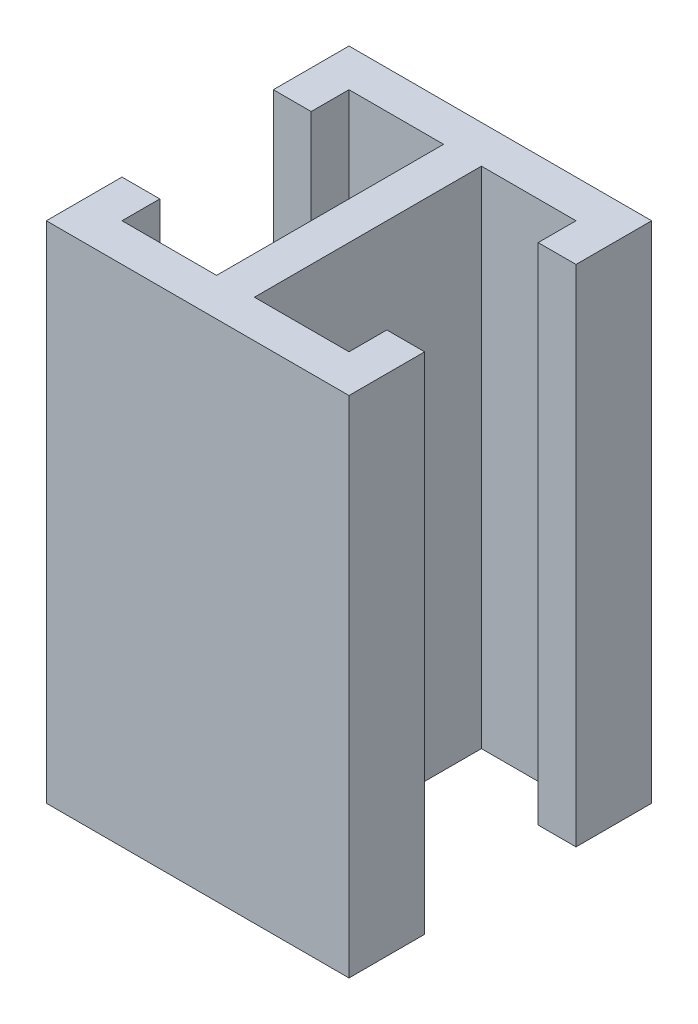
ISO-10303-21;
HEADER;
FILE_DESCRIPTION(('STEP AP214'),'2;1');
FILE_NAME('part.step','',(''),(''),'','','');
FILE_SCHEMA(('AUTOMOTIVE_DESIGN { 1 0 10303 214 1 1 1 1 }'));
ENDSEC;
DATA;
#1=APPLICATION_CONTEXT('core data for automotive mechanical design processes');
#2=APPLICATION_PROTOCOL_DEFINITION('international standard','automotive_design',2000,#1);
#3=PRODUCT_CONTEXT('',#1,'mechanical');
#4=PRODUCT('Part','Part','',(#3));
#5=PRODUCT_RELATED_PRODUCT_CATEGORY('part','',(#4));
#6=PRODUCT_DEFINITION_FORMATION('','',#4);
#7=PRODUCT_DEFINITION_CONTEXT('part definition',#1,'design');
#8=PRODUCT_DEFINITION('design','',#6,#7);
#9=PRODUCT_DEFINITION_SHAPE('','',#8);
#10=(LENGTH_UNIT() NAMED_UNIT(*) SI_UNIT(.MILLI.,.METRE.));
#11=(NAMED_UNIT(*) PLANE_ANGLE_UNIT() SI_UNIT($,.RADIAN.));
#12=(NAMED_UNIT(*) SI_UNIT($,.STERADIAN.) SOLID_ANGLE_UNIT());
#13=UNCERTAINTY_MEASURE_WITH_UNIT(LENGTH_MEASURE(1.E-05),#10,'distance_accuracy_value','');
#14=(GEOMETRIC_REPRESENTATION_CONTEXT(3) GLOBAL_UNCERTAINTY_ASSIGNED_CONTEXT((#13)) GLOBAL_UNIT_ASSIGNED_CONTEXT((#10,
#11,#12)) REPRESENTATION_CONTEXT('',''));
#15=CARTESIAN_POINT('',(0.,0.,0.));
#16=DIRECTION('',(0.,0.,1.));
#17=DIRECTION('',(1.,0.,0.));
#18=AXIS2_PLACEMENT_3D('',#15,#16,#17);
#19=CARTESIAN_POINT('',(0.,200.,0.));
#20=DIRECTION('',(1.,0.,0.));
#21=DIRECTION('',(0.,0.,-1.));
#22=AXIS2_PLACEMENT_3D('',#19,#20,#21);
#23=PLANE('',#22);
#24=DIRECTION('',(0.,0.,1.));
#25=VECTOR('',#24,1.);
#26=CARTESIAN_POINT('',(0.,0.,0.));
#27=LINE('',#26,#25);
#28=CARTESIAN_POINT('',(0.,0.,-30.));
#29=VERTEX_POINT('',#28);
#30=CARTESIAN_POINT('',(0.,0.,0.));
#31=VERTEX_POINT('',#30);
#32=EDGE_CURVE('E208',#29,#31,#27,.T.);
#33=ORIENTED_EDGE('',*,*,#32,.T.);
#34=DIRECTION('',(0.,-1.,0.));
#35=VECTOR('',#34,1.);
#36=CARTESIAN_POINT('',(0.,200.,0.));
#37=LINE('',#36,#35);
#38=CARTESIAN_POINT('',(0.,200.,0.));
#39=VERTEX_POINT('',#38);
#40=EDGE_CURVE('E11',#39,#31,#37,.T.);
#41=ORIENTED_EDGE('',*,*,#40,.F.);
#42=DIRECTION('',(0.,0.,1.));
#43=VECTOR('',#42,1.);
#44=CARTESIAN_POINT('',(0.,200.,0.));
#45=LINE('',#44,#43);
#46=CARTESIAN_POINT('',(0.,200.,-30.));
#47=VERTEX_POINT('',#46);
#48=EDGE_CURVE('E246',#47,#39,#45,.T.);
#49=ORIENTED_EDGE('',*,*,#48,.F.);
#50=DIRECTION('',(0.,-1.,0.));
#51=VECTOR('',#50,1.);
#52=CARTESIAN_POINT('',(0.,200.,-30.));
#53=LINE('',#52,#51);
#54=EDGE_CURVE('E204',#47,#29,#53,.T.);
#55=ORIENTED_EDGE('',*,*,#54,.T.);
#56=EDGE_LOOP('',(#33,#41,#49,#55));
#57=FACE_BOUND('',#56,.T.);
#58=ADVANCED_FACE('F40',(#57),#23,.F.);
#59=CARTESIAN_POINT('',(0.,200.,0.));
#60=DIRECTION('',(0.,0.,-1.));
#61=DIRECTION('',(-1.,0.,0.));
#62=AXIS2_PLACEMENT_3D('',#59,#60,#61);
#63=PLANE('',#62);
#64=DIRECTION('',(1.,0.,0.));
#65=VECTOR('',#64,1.);
#66=CARTESIAN_POINT('',(0.,0.,0.));
#67=LINE('',#66,#65);
#68=CARTESIAN_POINT('',(120.,0.,0.));
#69=VERTEX_POINT('',#68);
#70=EDGE_CURVE('E211',#31,#69,#67,.T.);
#71=ORIENTED_EDGE('',*,*,#70,.T.);
#72=DIRECTION('',(0.,-1.,0.));
#73=VECTOR('',#72,1.);
#74=CARTESIAN_POINT('',(120.,200.,0.));
#75=LINE('',#74,#73);
#76=CARTESIAN_POINT('',(120.,200.,0.));
#77=VERTEX_POINT('',#76);
#78=EDGE_CURVE('E48',#77,#69,#75,.T.);
#79=ORIENTED_EDGE('',*,*,#78,.F.);
#80=DIRECTION('',(1.,0.,0.));
#81=VECTOR('',#80,1.);
#82=CARTESIAN_POINT('',(0.,200.,0.));
#83=LINE('',#82,#81);
#84=EDGE_CURVE('E135',#39,#77,#83,.T.);
#85=ORIENTED_EDGE('',*,*,#84,.F.);
#86=ORIENTED_EDGE('',*,*,#40,.T.);
#87=EDGE_LOOP('',(#71,#79,#85,#86));
#88=FACE_BOUND('',#87,.T.);
#89=ADVANCED_FACE('F364',(#88),#63,.F.);
#90=CARTESIAN_POINT('',(120.,200.,0.));
#91=DIRECTION('',(-1.,0.,0.));
#92=DIRECTION('',(0.,0.,1.));
#93=AXIS2_PLACEMENT_3D('',#90,#91,#92);
#94=PLANE('',#93);
#95=DIRECTION('',(0.,0.,-1.));
#96=VECTOR('',#95,1.);
#97=CARTESIAN_POINT('',(120.,0.,0.));
#98=LINE('',#97,#96);
#99=CARTESIAN_POINT('',(120.,0.,-30.));
#100=VERTEX_POINT('',#99);
#101=EDGE_CURVE('E213',#69,#100,#98,.T.);
#102=ORIENTED_EDGE('',*,*,#101,.T.);
#103=DIRECTION('',(0.,-1.,0.));
#104=VECTOR('',#103,1.);
#105=CARTESIAN_POINT('',(120.,200.,-30.));
#106=LINE('',#105,#104);
#107=CARTESIAN_POINT('',(120.,200.,-30.));
#108=VERTEX_POINT('',#107);
#109=EDGE_CURVE('E289',#108,#100,#106,.T.);
#110=ORIENTED_EDGE('',*,*,#109,.F.);
#111=DIRECTION('',(0.,0.,-1.));
#112=VECTOR('',#111,1.);
#113=CARTESIAN_POINT('',(120.,200.,0.));
#114=LINE('',#113,#112);
#115=EDGE_CURVE('E297',#77,#108,#114,.T.);
#116=ORIENTED_EDGE('',*,*,#115,.F.);
#117=ORIENTED_EDGE('',*,*,#78,.T.);
#118=EDGE_LOOP('',(#102,#110,#116,#117));
#119=FACE_BOUND('',#118,.T.);
#120=ADVANCED_FACE('F295',(#119),#94,.F.);
#121=CARTESIAN_POINT('',(105.,200.,-30.));
#122=DIRECTION('',(0.,0.,1.));
#123=DIRECTION('',(1.,0.,0.));
#124=AXIS2_PLACEMENT_3D('',#121,#122,#123);
#125=PLANE('',#124);
#126=DIRECTION('',(-1.,0.,0.));
#127=VECTOR('',#126,1.);
#128=CARTESIAN_POINT('',(105.,0.,-30.));
#129=LINE('',#128,#127);
#130=CARTESIAN_POINT('',(105.,0.,-30.));
#131=VERTEX_POINT('',#130);
#132=EDGE_CURVE('E215',#100,#131,#129,.T.);
#133=ORIENTED_EDGE('',*,*,#132,.T.);
#134=DIRECTION('',(0.,-1.,0.));
#135=VECTOR('',#134,1.);
#136=CARTESIAN_POINT('',(105.,200.,-30.));
#137=LINE('',#136,#135);
#138=CARTESIAN_POINT('',(105.,200.,-30.));
#139=VERTEX_POINT('',#138);
#140=EDGE_CURVE('E286',#139,#131,#137,.T.);
#141=ORIENTED_EDGE('',*,*,#140,.F.);
#142=DIRECTION('',(-1.,0.,0.));
#143=VECTOR('',#142,1.);
#144=CARTESIAN_POINT('',(105.,200.,-30.));
#145=LINE('',#144,#143);
#146=EDGE_CURVE('E315',#108,#139,#145,.T.);
#147=ORIENTED_EDGE('',*,*,#146,.F.);
#148=ORIENTED_EDGE('',*,*,#109,.T.);
#149=EDGE_LOOP('',(#133,#141,#147,#148));
#150=FACE_BOUND('',#149,.T.);
#151=ADVANCED_FACE('F306',(#150),#125,.F.);
#152=CARTESIAN_POINT('',(105.,200.,-30.));
#153=DIRECTION('',(1.,0.,0.));
#154=DIRECTION('',(0.,0.,-1.));
#155=AXIS2_PLACEMENT_3D('',#152,#153,#154);
#156=PLANE('',#155);
#157=DIRECTION('',(0.,0.,1.));
#158=VECTOR('',#157,1.);
#159=CARTESIAN_POINT('',(105.,0.,-30.));
#160=LINE('',#159,#158);
#161=CARTESIAN_POINT('',(105.,0.,-15.));
#162=VERTEX_POINT('',#161);
#163=EDGE_CURVE('E217',#131,#162,#160,.T.);
#164=ORIENTED_EDGE('',*,*,#163,.T.);
#165=DIRECTION('',(0.,-1.,0.));
#166=VECTOR('',#165,1.);
#167=CARTESIAN_POINT('',(105.,200.,-15.));
#168=LINE('',#167,#166);
#169=CARTESIAN_POINT('',(105.,200.,-15.));
#170=VERTEX_POINT('',#169);
#171=EDGE_CURVE('E283',#170,#162,#168,.T.);
#172=ORIENTED_EDGE('',*,*,#171,.F.);
#173=DIRECTION('',(0.,0.,1.));
#174=VECTOR('',#173,1.);
#175=CARTESIAN_POINT('',(105.,200.,-30.));
#176=LINE('',#175,#174);
#177=EDGE_CURVE('E312',#139,#170,#176,.T.);
#178=ORIENTED_EDGE('',*,*,#177,.F.);
#179=ORIENTED_EDGE('',*,*,#140,.T.);
#180=EDGE_LOOP('',(#164,#172,#178,#179));
#181=FACE_BOUND('',#180,.T.);
#182=ADVANCED_FACE('F310',(#181),#156,.F.);
#183=CARTESIAN_POINT('',(67.5,200.,-15.));
#184=DIRECTION('',(0.,0.,1.));
#185=DIRECTION('',(1.,0.,0.));
#186=AXIS2_PLACEMENT_3D('',#183,#184,#185);
#187=PLANE('',#186);
#188=DIRECTION('',(-1.,0.,0.));
#189=VECTOR('',#188,1.);
#190=CARTESIAN_POINT('',(67.5,0.,-15.));
#191=LINE('',#190,#189);
#192=CARTESIAN_POINT('',(67.5,0.,-15.));
#193=VERTEX_POINT('',#192);
#194=EDGE_CURVE('E219',#162,#193,#191,.T.);
#195=ORIENTED_EDGE('',*,*,#194,.T.);
#196=DIRECTION('',(0.,-1.,0.));
#197=VECTOR('',#196,1.);
#198=CARTESIAN_POINT('',(67.5,200.,-15.));
#199=LINE('',#198,#197);
#200=CARTESIAN_POINT('',(67.5,200.,-15.));
#201=VERTEX_POINT('',#200);
#202=EDGE_CURVE('E280',#201,#193,#199,.T.);
#203=ORIENTED_EDGE('',*,*,#202,.F.);
#204=DIRECTION('',(-1.,0.,0.));
#205=VECTOR('',#204,1.);
#206=CARTESIAN_POINT('',(67.5,200.,-15.));
#207=LINE('',#206,#205);
#208=EDGE_CURVE('E314',#170,#201,#207,.T.);
#209=ORIENTED_EDGE('',*,*,#208,.F.);
#210=ORIENTED_EDGE('',*,*,#171,.T.);
#211=EDGE_LOOP('',(#195,#203,#209,#210));
#212=FACE_BOUND('',#211,.T.);
#213=ADVANCED_FACE('F377',(#212),#187,.F.);
#214=CARTESIAN_POINT('',(67.5,200.,-105.));
#215=DIRECTION('',(-1.,0.,0.));
#216=DIRECTION('',(0.,0.,1.));
#217=AXIS2_PLACEMENT_3D('',#214,#215,#216);
#218=PLANE('',#217);
#219=DIRECTION('',(0.,0.,-1.));
#220=VECTOR('',#219,1.);
#221=CARTESIAN_POINT('',(67.5,0.,-105.));
#222=LINE('',#221,#220);
#223=CARTESIAN_POINT('',(67.5,0.,-105.));
#224=VERTEX_POINT('',#223);
#225=EDGE_CURVE('E221',#193,#224,#222,.T.);
#226=ORIENTED_EDGE('',*,*,#225,.T.);
#227=DIRECTION('',(0.,-1.,0.));
#228=VECTOR('',#227,1.);
#229=CARTESIAN_POINT('',(67.5,200.,-105.));
#230=LINE('',#229,#228);
#231=CARTESIAN_POINT('',(67.5,200.,-105.));
#232=VERTEX_POINT('',#231);
#233=EDGE_CURVE('E277',#232,#224,#230,.T.);
#234=ORIENTED_EDGE('',*,*,#233,.F.);
#235=DIRECTION('',(0.,0.,-1.));
#236=VECTOR('',#235,1.);
#237=CARTESIAN_POINT('',(67.5,200.,-105.));
#238=LINE('',#237,#236);
#239=EDGE_CURVE('E317',#201,#232,#238,.T.);
#240=ORIENTED_EDGE('',*,*,#239,.F.);
#241=ORIENTED_EDGE('',*,*,#202,.T.);
#242=EDGE_LOOP('',(#226,#234,#240,#241));
#243=FACE_BOUND('',#242,.T.);
#244=ADVANCED_FACE('F380',(#243),#218,.F.);
#245=CARTESIAN_POINT('',(67.5,200.,-105.));
#246=DIRECTION('',(0.,0.,-1.));
#247=DIRECTION('',(-1.,0.,0.));
#248=AXIS2_PLACEMENT_3D('',#245,#246,#247);
#249=PLANE('',#248);
#250=DIRECTION('',(1.,0.,0.));
#251=VECTOR('',#250,1.);
#252=CARTESIAN_POINT('',(67.5,0.,-105.));
#253=LINE('',#252,#251);
#254=CARTESIAN_POINT('',(105.,0.,-105.));
#255=VERTEX_POINT('',#254);
#256=EDGE_CURVE('E223',#224,#255,#253,.T.);
#257=ORIENTED_EDGE('',*,*,#256,.T.);
#258=DIRECTION('',(0.,-1.,0.));
#259=VECTOR('',#258,1.);
#260=CARTESIAN_POINT('',(105.,200.,-105.));
#261=LINE('',#260,#259);
#262=CARTESIAN_POINT('',(105.,200.,-105.));
#263=VERTEX_POINT('',#262);
#264=EDGE_CURVE('E274',#263,#255,#261,.T.);
#265=ORIENTED_EDGE('',*,*,#264,.F.);
#266=DIRECTION('',(1.,0.,0.));
#267=VECTOR('',#266,1.);
#268=CARTESIAN_POINT('',(67.5,200.,-105.));
#269=LINE('',#268,#267);
#270=EDGE_CURVE('E323',#232,#263,#269,.T.);
#271=ORIENTED_EDGE('',*,*,#270,.F.);
#272=ORIENTED_EDGE('',*,*,#233,.T.);
#273=EDGE_LOOP('',(#257,#265,#271,#272));
#274=FACE_BOUND('',#273,.T.);
#275=ADVANCED_FACE('F384',(#274),#249,.F.);
#276=CARTESIAN_POINT('',(105.,200.,-105.));
#277=DIRECTION('',(1.,0.,0.));
#278=DIRECTION('',(0.,0.,-1.));
#279=AXIS2_PLACEMENT_3D('',#276,#277,#278);
#280=PLANE('',#279);
#281=DIRECTION('',(0.,0.,1.));
#282=VECTOR('',#281,1.);
#283=CARTESIAN_POINT('',(105.,0.,-105.));
#284=LINE('',#283,#282);
#285=CARTESIAN_POINT('',(105.,0.,-90.));
#286=VERTEX_POINT('',#285);
#287=EDGE_CURVE('E225',#255,#286,#284,.T.);
#288=ORIENTED_EDGE('',*,*,#287,.T.);
#289=DIRECTION('',(0.,-1.,0.));
#290=VECTOR('',#289,1.);
#291=CARTESIAN_POINT('',(105.,200.,-90.));
#292=LINE('',#291,#290);
#293=CARTESIAN_POINT('',(105.,200.,-90.));
#294=VERTEX_POINT('',#293);
#295=EDGE_CURVE('E271',#294,#286,#292,.T.);
#296=ORIENTED_EDGE('',*,*,#295,.F.);
#297=DIRECTION('',(0.,0.,1.));
#298=VECTOR('',#297,1.);
#299=CARTESIAN_POINT('',(105.,200.,-105.));
#300=LINE('',#299,#298);
#301=EDGE_CURVE('E325',#263,#294,#300,.T.);
#302=ORIENTED_EDGE('',*,*,#301,.F.);
#303=ORIENTED_EDGE('',*,*,#264,.T.);
#304=EDGE_LOOP('',(#288,#296,#302,#303));
#305=FACE_BOUND('',#304,.T.);
#306=ADVANCED_FACE('F388',(#305),#280,.F.);
#307=CARTESIAN_POINT('',(105.,200.,-90.));
#308=DIRECTION('',(0.,0.,-1.));
#309=DIRECTION('',(-1.,0.,0.));
#310=AXIS2_PLACEMENT_3D('',#307,#308,#309);
#311=PLANE('',#310);
#312=DIRECTION('',(1.,0.,0.));
#313=VECTOR('',#312,1.);
#314=CARTESIAN_POINT('',(105.,0.,-90.));
#315=LINE('',#314,#313);
#316=CARTESIAN_POINT('',(120.,0.,-90.));
#317=VERTEX_POINT('',#316);
#318=EDGE_CURVE('E227',#286,#317,#315,.T.);
#319=ORIENTED_EDGE('',*,*,#318,.T.);
#320=DIRECTION('',(0.,-1.,0.));
#321=VECTOR('',#320,1.);
#322=CARTESIAN_POINT('',(120.,200.,-90.));
#323=LINE('',#322,#321);
#324=CARTESIAN_POINT('',(120.,200.,-90.));
#325=VERTEX_POINT('',#324);
#326=EDGE_CURVE('E268',#325,#317,#323,.T.);
#327=ORIENTED_EDGE('',*,*,#326,.F.);
#328=DIRECTION('',(1.,0.,0.));
#329=VECTOR('',#328,1.);
#330=CARTESIAN_POINT('',(105.,200.,-90.));
#331=LINE('',#330,#329);
#332=EDGE_CURVE('E327',#294,#325,#331,.T.);
#333=ORIENTED_EDGE('',*,*,#332,.F.);
#334=ORIENTED_EDGE('',*,*,#295,.T.);
#335=EDGE_LOOP('',(#319,#327,#333,#334));
#336=FACE_BOUND('',#335,.T.);
#337=ADVANCED_FACE('F392',(#336),#311,.F.);
#338=CARTESIAN_POINT('',(120.,200.,-90.));
#339=DIRECTION('',(-1.,0.,0.));
#340=DIRECTION('',(0.,0.,1.));
#341=AXIS2_PLACEMENT_3D('',#338,#339,#340);
#342=PLANE('',#341);
#343=DIRECTION('',(0.,0.,-1.));
#344=VECTOR('',#343,1.);
#345=CARTESIAN_POINT('',(120.,0.,-90.));
#346=LINE('',#345,#344);
#347=CARTESIAN_POINT('',(120.,0.,-120.));
#348=VERTEX_POINT('',#347);
#349=EDGE_CURVE('E229',#317,#348,#346,.T.);
#350=ORIENTED_EDGE('',*,*,#349,.T.);
#351=DIRECTION('',(0.,-1.,0.));
#352=VECTOR('',#351,1.);
#353=CARTESIAN_POINT('',(120.,200.,-120.));
#354=LINE('',#353,#352);
#355=CARTESIAN_POINT('',(120.,200.,-120.));
#356=VERTEX_POINT('',#355);
#357=EDGE_CURVE('E265',#356,#348,#354,.T.);
#358=ORIENTED_EDGE('',*,*,#357,.F.);
#359=DIRECTION('',(0.,0.,-1.));
#360=VECTOR('',#359,1.);
#361=CARTESIAN_POINT('',(120.,200.,-90.));
#362=LINE('',#361,#360);
#363=EDGE_CURVE('E329',#325,#356,#362,.T.);
#364=ORIENTED_EDGE('',*,*,#363,.F.);
#365=ORIENTED_EDGE('',*,*,#326,.T.);
#366=EDGE_LOOP('',(#350,#358,#364,#365));
#367=FACE_BOUND('',#366,.T.);
#368=ADVANCED_FACE('F396',(#367),#342,.F.);
#369=CARTESIAN_POINT('',(0.,200.,-120.));
#370=DIRECTION('',(0.,0.,1.));
#371=DIRECTION('',(1.,0.,0.));
#372=AXIS2_PLACEMENT_3D('',#369,#370,#371);
#373=PLANE('',#372);
#374=DIRECTION('',(-1.,0.,0.));
#375=VECTOR('',#374,1.);
#376=CARTESIAN_POINT('',(0.,0.,-120.));
#377=LINE('',#376,#375);
#378=CARTESIAN_POINT('',(0.,0.,-120.));
#379=VERTEX_POINT('',#378);
#380=EDGE_CURVE('E231',#348,#379,#377,.T.);
#381=ORIENTED_EDGE('',*,*,#380,.T.);
#382=DIRECTION('',(0.,-1.,0.));
#383=VECTOR('',#382,1.);
#384=CARTESIAN_POINT('',(0.,200.,-120.));
#385=LINE('',#384,#383);
#386=CARTESIAN_POINT('',(0.,200.,-120.));
#387=VERTEX_POINT('',#386);
#388=EDGE_CURVE('E262',#387,#379,#385,.T.);
#389=ORIENTED_EDGE('',*,*,#388,.F.);
#390=DIRECTION('',(-1.,0.,0.));
#391=VECTOR('',#390,1.);
#392=CARTESIAN_POINT('',(0.,200.,-120.));
#393=LINE('',#392,#391);
#394=EDGE_CURVE('E331',#356,#387,#393,.T.);
#395=ORIENTED_EDGE('',*,*,#394,.F.);
#396=ORIENTED_EDGE('',*,*,#357,.T.);
#397=EDGE_LOOP('',(#381,#389,#395,#396));
#398=FACE_BOUND('',#397,.T.);
#399=ADVANCED_FACE('F400',(#398),#373,.F.);
#400=CARTESIAN_POINT('',(0.,200.,-90.));
#401=DIRECTION('',(1.,0.,0.));
#402=DIRECTION('',(0.,0.,-1.));
#403=AXIS2_PLACEMENT_3D('',#400,#401,#402);
#404=PLANE('',#403);
#405=DIRECTION('',(0.,0.,1.));
#406=VECTOR('',#405,1.);
#407=CARTESIAN_POINT('',(0.,0.,-90.));
#408=LINE('',#407,#406);
#409=CARTESIAN_POINT('',(0.,0.,-90.));
#410=VERTEX_POINT('',#409);
#411=EDGE_CURVE('E233',#379,#410,#408,.T.);
#412=ORIENTED_EDGE('',*,*,#411,.T.);
#413=DIRECTION('',(0.,-1.,0.));
#414=VECTOR('',#413,1.);
#415=CARTESIAN_POINT('',(0.,200.,-90.));
#416=LINE('',#415,#414);
#417=CARTESIAN_POINT('',(0.,200.,-90.));
#418=VERTEX_POINT('',#417);
#419=EDGE_CURVE('E259',#418,#410,#416,.T.);
#420=ORIENTED_EDGE('',*,*,#419,.F.);
#421=DIRECTION('',(0.,0.,1.));
#422=VECTOR('',#421,1.);
#423=CARTESIAN_POINT('',(0.,200.,-90.));
#424=LINE('',#423,#422);
#425=EDGE_CURVE('E333',#387,#418,#424,.T.);
#426=ORIENTED_EDGE('',*,*,#425,.F.);
#427=ORIENTED_EDGE('',*,*,#388,.T.);
#428=EDGE_LOOP('',(#412,#420,#426,#427));
#429=FACE_BOUND('',#428,.T.);
#430=ADVANCED_FACE('F404',(#429),#404,.F.);
#431=CARTESIAN_POINT('',(15.,200.,-90.));
#432=DIRECTION('',(0.,0.,-1.));
#433=DIRECTION('',(-1.,0.,0.));
#434=AXIS2_PLACEMENT_3D('',#431,#432,#433);
#435=PLANE('',#434);
#436=DIRECTION('',(1.,0.,0.));
#437=VECTOR('',#436,1.);
#438=CARTESIAN_POINT('',(15.,0.,-90.));
#439=LINE('',#438,#437);
#440=CARTESIAN_POINT('',(15.,0.,-90.));
#441=VERTEX_POINT('',#440);
#442=EDGE_CURVE('E235',#410,#441,#439,.T.);
#443=ORIENTED_EDGE('',*,*,#442,.T.);
#444=DIRECTION('',(0.,-1.,0.));
#445=VECTOR('',#444,1.);
#446=CARTESIAN_POINT('',(15.,200.,-90.));
#447=LINE('',#446,#445);
#448=CARTESIAN_POINT('',(15.,200.,-90.));
#449=VERTEX_POINT('',#448);
#450=EDGE_CURVE('E256',#449,#441,#447,.T.);
#451=ORIENTED_EDGE('',*,*,#450,.F.);
#452=DIRECTION('',(1.,0.,0.));
#453=VECTOR('',#452,1.);
#454=CARTESIAN_POINT('',(15.,200.,-90.));
#455=LINE('',#454,#453);
#456=EDGE_CURVE('E335',#418,#449,#455,.T.);
#457=ORIENTED_EDGE('',*,*,#456,.F.);
#458=ORIENTED_EDGE('',*,*,#419,.T.);
#459=EDGE_LOOP('',(#443,#451,#457,#458));
#460=FACE_BOUND('',#459,.T.);
#461=ADVANCED_FACE('F408',(#460),#435,.F.);
#462=CARTESIAN_POINT('',(15.,200.,-105.));
#463=DIRECTION('',(-1.,0.,0.));
#464=DIRECTION('',(0.,0.,1.));
#465=AXIS2_PLACEMENT_3D('',#462,#463,#464);
#466=PLANE('',#465);
#467=DIRECTION('',(0.,0.,-1.));
#468=VECTOR('',#467,1.);
#469=CARTESIAN_POINT('',(15.,0.,-105.));
#470=LINE('',#469,#468);
#471=CARTESIAN_POINT('',(15.,0.,-105.));
#472=VERTEX_POINT('',#471);
#473=EDGE_CURVE('E237',#441,#472,#470,.T.);
#474=ORIENTED_EDGE('',*,*,#473,.T.);
#475=DIRECTION('',(0.,-1.,0.));
#476=VECTOR('',#475,1.);
#477=CARTESIAN_POINT('',(15.,200.,-105.));
#478=LINE('',#477,#476);
#479=CARTESIAN_POINT('',(15.,200.,-105.));
#480=VERTEX_POINT('',#479);
#481=EDGE_CURVE('E253',#480,#472,#478,.T.);
#482=ORIENTED_EDGE('',*,*,#481,.F.);
#483=DIRECTION('',(0.,0.,-1.));
#484=VECTOR('',#483,1.);
#485=CARTESIAN_POINT('',(15.,200.,-105.));
#486=LINE('',#485,#484);
#487=EDGE_CURVE('E337',#449,#480,#486,.T.);
#488=ORIENTED_EDGE('',*,*,#487,.F.);
#489=ORIENTED_EDGE('',*,*,#450,.T.);
#490=EDGE_LOOP('',(#474,#482,#488,#489));
#491=FACE_BOUND('',#490,.T.);
#492=ADVANCED_FACE('F412',(#491),#466,.F.);
#493=CARTESIAN_POINT('',(52.5,200.,-105.));
#494=DIRECTION('',(0.,0.,-1.));
#495=DIRECTION('',(-1.,0.,0.));
#496=AXIS2_PLACEMENT_3D('',#493,#494,#495);
#497=PLANE('',#496);
#498=DIRECTION('',(1.,0.,0.));
#499=VECTOR('',#498,1.);
#500=CARTESIAN_POINT('',(52.5,0.,-105.));
#501=LINE('',#500,#499);
#502=CARTESIAN_POINT('',(52.5,0.,-105.));
#503=VERTEX_POINT('',#502);
#504=EDGE_CURVE('E239',#472,#503,#501,.T.);
#505=ORIENTED_EDGE('',*,*,#504,.T.);
#506=DIRECTION('',(0.,-1.,0.));
#507=VECTOR('',#506,1.);
#508=CARTESIAN_POINT('',(52.5,200.,-105.));
#509=LINE('',#508,#507);
#510=CARTESIAN_POINT('',(52.5,200.,-105.));
#511=VERTEX_POINT('',#510);
#512=EDGE_CURVE('E250',#511,#503,#509,.T.);
#513=ORIENTED_EDGE('',*,*,#512,.F.);
#514=DIRECTION('',(1.,0.,0.));
#515=VECTOR('',#514,1.);
#516=CARTESIAN_POINT('',(52.5,200.,-105.));
#517=LINE('',#516,#515);
#518=EDGE_CURVE('E339',#480,#511,#517,.T.);
#519=ORIENTED_EDGE('',*,*,#518,.F.);
#520=ORIENTED_EDGE('',*,*,#481,.T.);
#521=EDGE_LOOP('',(#505,#513,#519,#520));
#522=FACE_BOUND('',#521,.T.);
#523=ADVANCED_FACE('F345',(#522),#497,.F.);
#524=CARTESIAN_POINT('',(52.5,200.,-105.));
#525=DIRECTION('',(1.,0.,0.));
#526=DIRECTION('',(0.,0.,-1.));
#527=AXIS2_PLACEMENT_3D('',#524,#525,#526);
#528=PLANE('',#527);
#529=DIRECTION('',(0.,0.,1.));
#530=VECTOR('',#529,1.);
#531=CARTESIAN_POINT('',(52.5,0.,-105.));
#532=LINE('',#531,#530);
#533=CARTESIAN_POINT('',(52.5,0.,-15.));
#534=VERTEX_POINT('',#533);
#535=EDGE_CURVE('E241',#503,#534,#532,.T.);
#536=ORIENTED_EDGE('',*,*,#535,.T.);
#537=DIRECTION('',(0.,-1.,0.));
#538=VECTOR('',#537,1.);
#539=CARTESIAN_POINT('',(52.5,200.,-15.));
#540=LINE('',#539,#538);
#541=CARTESIAN_POINT('',(52.5,200.,-15.));
#542=VERTEX_POINT('',#541);
#543=EDGE_CURVE('E199',#542,#534,#540,.T.);
#544=ORIENTED_EDGE('',*,*,#543,.F.);
#545=DIRECTION('',(0.,0.,1.));
#546=VECTOR('',#545,1.);
#547=CARTESIAN_POINT('',(52.5,200.,-105.));
#548=LINE('',#547,#546);
#549=EDGE_CURVE('E190',#511,#542,#548,.T.);
#550=ORIENTED_EDGE('',*,*,#549,.F.);
#551=ORIENTED_EDGE('',*,*,#512,.T.);
#552=EDGE_LOOP('',(#536,#544,#550,#551));
#553=FACE_BOUND('',#552,.T.);
#554=ADVANCED_FACE('F349',(#553),#528,.F.);
#555=CARTESIAN_POINT('',(52.5,200.,-15.));
#556=DIRECTION('',(0.,0.,1.));
#557=DIRECTION('',(1.,0.,0.));
#558=AXIS2_PLACEMENT_3D('',#555,#556,#557);
#559=PLANE('',#558);
#560=DIRECTION('',(-1.,0.,0.));
#561=VECTOR('',#560,1.);
#562=CARTESIAN_POINT('',(52.5,0.,-15.));
#563=LINE('',#562,#561);
#564=CARTESIAN_POINT('',(15.,0.,-15.));
#565=VERTEX_POINT('',#564);
#566=EDGE_CURVE('E198',#534,#565,#563,.T.);
#567=ORIENTED_EDGE('',*,*,#566,.T.);
#568=DIRECTION('',(0.,-1.,0.));
#569=VECTOR('',#568,1.);
#570=CARTESIAN_POINT('',(15.,200.,-15.));
#571=LINE('',#570,#569);
#572=CARTESIAN_POINT('',(15.,200.,-15.));
#573=VERTEX_POINT('',#572);
#574=EDGE_CURVE('E195',#573,#565,#571,.T.);
#575=ORIENTED_EDGE('',*,*,#574,.F.);
#576=DIRECTION('',(-1.,0.,0.));
#577=VECTOR('',#576,1.);
#578=CARTESIAN_POINT('',(52.5,200.,-15.));
#579=LINE('',#578,#577);
#580=EDGE_CURVE('E184',#542,#573,#579,.T.);
#581=ORIENTED_EDGE('',*,*,#580,.F.);
#582=ORIENTED_EDGE('',*,*,#543,.T.);
#583=EDGE_LOOP('',(#567,#575,#581,#582));
#584=FACE_BOUND('',#583,.T.);
#585=ADVANCED_FACE('F196',(#584),#559,.F.);
#586=CARTESIAN_POINT('',(15.,200.,-30.));
#587=DIRECTION('',(-1.,0.,0.));
#588=DIRECTION('',(0.,0.,1.));
#589=AXIS2_PLACEMENT_3D('',#586,#587,#588);
#590=PLANE('',#589);
#591=DIRECTION('',(0.,0.,-1.));
#592=VECTOR('',#591,1.);
#593=CARTESIAN_POINT('',(15.,0.,-30.));
#594=LINE('',#593,#592);
#595=CARTESIAN_POINT('',(15.,0.,-30.));
#596=VERTEX_POINT('',#595);
#597=EDGE_CURVE('E121',#565,#596,#594,.T.);
#598=ORIENTED_EDGE('',*,*,#597,.T.);
#599=DIRECTION('',(0.,-1.,0.));
#600=VECTOR('',#599,1.);
#601=CARTESIAN_POINT('',(15.,200.,-30.));
#602=LINE('',#601,#600);
#603=CARTESIAN_POINT('',(15.,200.,-30.));
#604=VERTEX_POINT('',#603);
#605=EDGE_CURVE('E200',#604,#596,#602,.T.);
#606=ORIENTED_EDGE('',*,*,#605,.F.);
#607=DIRECTION('',(0.,0.,-1.));
#608=VECTOR('',#607,1.);
#609=CARTESIAN_POINT('',(15.,200.,-30.));
#610=LINE('',#609,#608);
#611=EDGE_CURVE('E188',#573,#604,#610,.T.);
#612=ORIENTED_EDGE('',*,*,#611,.F.);
#613=ORIENTED_EDGE('',*,*,#574,.T.);
#614=EDGE_LOOP('',(#598,#606,#612,#613));
#615=FACE_BOUND('',#614,.T.);
#616=ADVANCED_FACE('F202',(#615),#590,.F.);
#617=CARTESIAN_POINT('',(15.,200.,-30.));
#618=DIRECTION('',(0.,0.,1.));
#619=DIRECTION('',(1.,0.,0.));
#620=AXIS2_PLACEMENT_3D('',#617,#618,#619);
#621=PLANE('',#620);
#622=DIRECTION('',(-1.,0.,0.));
#623=VECTOR('',#622,1.);
#624=CARTESIAN_POINT('',(15.,0.,-30.));
#625=LINE('',#624,#623);
#626=EDGE_CURVE('E127',#596,#29,#625,.T.);
#627=ORIENTED_EDGE('',*,*,#626,.T.);
#628=ORIENTED_EDGE('',*,*,#54,.F.);
#629=DIRECTION('',(-1.,0.,0.));
#630=VECTOR('',#629,1.);
#631=CARTESIAN_POINT('',(15.,200.,-30.));
#632=LINE('',#631,#630);
#633=EDGE_CURVE('E56',#604,#47,#632,.T.);
#634=ORIENTED_EDGE('',*,*,#633,.F.);
#635=ORIENTED_EDGE('',*,*,#605,.T.);
#636=EDGE_LOOP('',(#627,#628,#634,#635));
#637=FACE_BOUND('',#636,.T.);
#638=ADVANCED_FACE('F353',(#637),#621,.F.);
#639=CARTESIAN_POINT('',(0.,200.,0.));
#640=DIRECTION('',(0.,1.,0.));
#641=DIRECTION('',(0.,0.,1.));
#642=AXIS2_PLACEMENT_3D('',#639,#640,#641);
#643=PLANE('',#642);
#644=ORIENTED_EDGE('',*,*,#48,.T.);
#645=ORIENTED_EDGE('',*,*,#84,.T.);
#646=ORIENTED_EDGE('',*,*,#115,.T.);
#647=ORIENTED_EDGE('',*,*,#146,.T.);
#648=ORIENTED_EDGE('',*,*,#177,.T.);
#649=ORIENTED_EDGE('',*,*,#208,.T.);
#650=ORIENTED_EDGE('',*,*,#239,.T.);
#651=ORIENTED_EDGE('',*,*,#270,.T.);
#652=ORIENTED_EDGE('',*,*,#301,.T.);
#653=ORIENTED_EDGE('',*,*,#332,.T.);
#654=ORIENTED_EDGE('',*,*,#363,.T.);
#655=ORIENTED_EDGE('',*,*,#394,.T.);
#656=ORIENTED_EDGE('',*,*,#425,.T.);
#657=ORIENTED_EDGE('',*,*,#456,.T.);
#658=ORIENTED_EDGE('',*,*,#487,.T.);
#659=ORIENTED_EDGE('',*,*,#518,.T.);
#660=ORIENTED_EDGE('',*,*,#549,.T.);
#661=ORIENTED_EDGE('',*,*,#580,.T.);
#662=ORIENTED_EDGE('',*,*,#611,.T.);
#663=ORIENTED_EDGE('',*,*,#633,.T.);
#664=EDGE_LOOP('',(#644,#645,#646,#647,#648,#649,#650,#651,#652,#653,#654,#655,#656,#657,#658,
#659,#660,#661,#662,#663));
#665=FACE_BOUND('',#664,.T.);
#666=ADVANCED_FACE('F186',(#665),#643,.T.);
#667=CARTESIAN_POINT('',(0.,0.,0.));
#668=DIRECTION('',(0.,1.,0.));
#669=DIRECTION('',(0.,0.,1.));
#670=AXIS2_PLACEMENT_3D('',#667,#668,#669);
#671=PLANE('',#670);
#672=ORIENTED_EDGE('',*,*,#32,.F.);
#673=ORIENTED_EDGE('',*,*,#626,.F.);
#674=ORIENTED_EDGE('',*,*,#597,.F.);
#675=ORIENTED_EDGE('',*,*,#566,.F.);
#676=ORIENTED_EDGE('',*,*,#535,.F.);
#677=ORIENTED_EDGE('',*,*,#504,.F.);
#678=ORIENTED_EDGE('',*,*,#473,.F.);
#679=ORIENTED_EDGE('',*,*,#442,.F.);
#680=ORIENTED_EDGE('',*,*,#411,.F.);
#681=ORIENTED_EDGE('',*,*,#380,.F.);
#682=ORIENTED_EDGE('',*,*,#349,.F.);
#683=ORIENTED_EDGE('',*,*,#318,.F.);
#684=ORIENTED_EDGE('',*,*,#287,.F.);
#685=ORIENTED_EDGE('',*,*,#256,.F.);
#686=ORIENTED_EDGE('',*,*,#225,.F.);
#687=ORIENTED_EDGE('',*,*,#194,.F.);
#688=ORIENTED_EDGE('',*,*,#163,.F.);
#689=ORIENTED_EDGE('',*,*,#132,.F.);
#690=ORIENTED_EDGE('',*,*,#101,.F.);
#691=ORIENTED_EDGE('',*,*,#70,.F.);
#692=EDGE_LOOP('',(#672,#673,#674,#675,#676,#677,#678,#679,#680,#681,#682,#683,#684,#685,#686,
#687,#688,#689,#690,#691));
#693=FACE_BOUND('',#692,.T.);
#694=ADVANCED_FACE('F301',(#693),#671,.F.);
#695=CLOSED_SHELL('',(#58,#89,#120,#151,#182,#213,#244,#275,#306,#337,#368,#399,#430,#461,#492,
#523,#554,#585,#616,#638,#666,#694));
#696=MANIFOLD_SOLID_BREP('B2',#695);
#697=ADVANCED_BREP_SHAPE_REPRESENTATION('',(#18,#696),#14);
#698=SHAPE_DEFINITION_REPRESENTATION(#9,#697);
ENDSEC;
END-ISO-10303-21;
